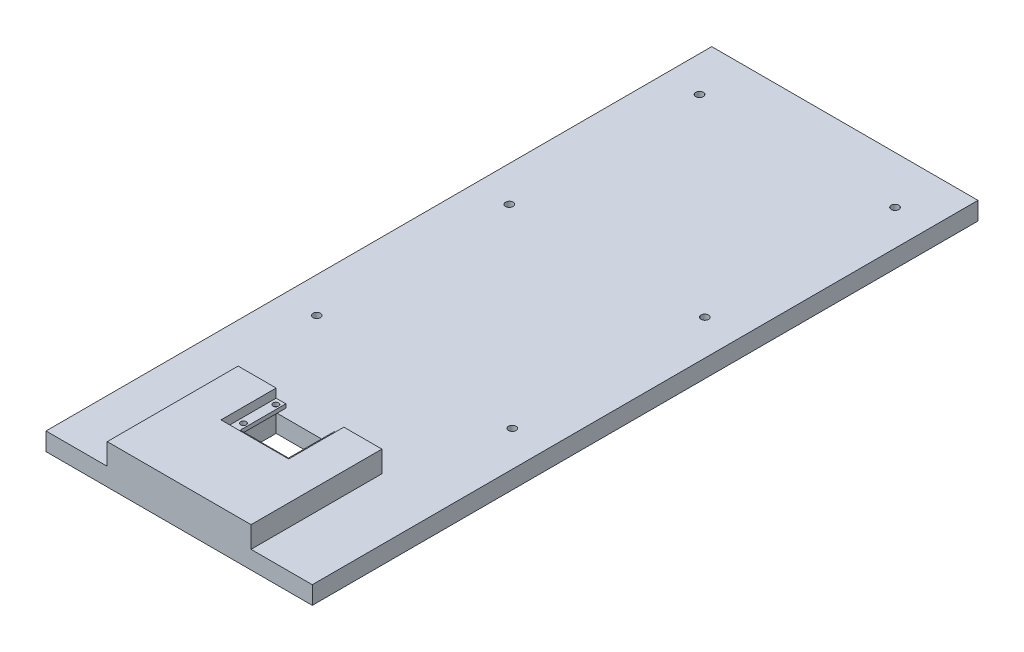
ISO-10303-21;
HEADER;
FILE_DESCRIPTION(('STEP AP214'),'2;1');
FILE_NAME('part.step','',(''),(''),'','','');
FILE_SCHEMA(('AUTOMOTIVE_DESIGN { 1 0 10303 214 1 1 1 1 }'));
ENDSEC;
DATA;
#1=APPLICATION_CONTEXT('core data for automotive mechanical design processes');
#2=APPLICATION_PROTOCOL_DEFINITION('international standard','automotive_design',2000,#1);
#3=PRODUCT_CONTEXT('',#1,'mechanical');
#4=PRODUCT('Part','Part','',(#3));
#5=PRODUCT_RELATED_PRODUCT_CATEGORY('part','',(#4));
#6=PRODUCT_DEFINITION_FORMATION('','',#4);
#7=PRODUCT_DEFINITION_CONTEXT('part definition',#1,'design');
#8=PRODUCT_DEFINITION('design','',#6,#7);
#9=PRODUCT_DEFINITION_SHAPE('','',#8);
#10=(LENGTH_UNIT() NAMED_UNIT(*) SI_UNIT(.MILLI.,.METRE.));
#11=(NAMED_UNIT(*) PLANE_ANGLE_UNIT() SI_UNIT($,.RADIAN.));
#12=(NAMED_UNIT(*) SI_UNIT($,.STERADIAN.) SOLID_ANGLE_UNIT());
#13=UNCERTAINTY_MEASURE_WITH_UNIT(LENGTH_MEASURE(1.E-05),#10,'distance_accuracy_value','');
#14=(GEOMETRIC_REPRESENTATION_CONTEXT(3) GLOBAL_UNCERTAINTY_ASSIGNED_CONTEXT((#13)) GLOBAL_UNIT_ASSIGNED_CONTEXT((#10,
#11,#12)) REPRESENTATION_CONTEXT('',''));
#15=CARTESIAN_POINT('',(0.,0.,0.));
#16=DIRECTION('',(0.,0.,1.));
#17=DIRECTION('',(1.,0.,0.));
#18=AXIS2_PLACEMENT_3D('',#15,#16,#17);
#19=CARTESIAN_POINT('',(0.,-4.62,0.));
#20=DIRECTION('',(0.,-1.,0.));
#21=DIRECTION('',(0.,0.,-1.));
#22=AXIS2_PLACEMENT_3D('',#19,#20,#21);
#23=PLANE('',#22);
#24=CARTESIAN_POINT('',(51.4,-4.62,-159.2));
#25=DIRECTION('',(0.,1.,0.));
#26=DIRECTION('',(0.,0.,1.));
#27=AXIS2_PLACEMENT_3D('',#24,#25,#26);
#28=CIRCLE('',#27,2.);
#29=CARTESIAN_POINT('',(51.4,-4.62,-157.2));
#30=VERTEX_POINT('',#29);
#31=EDGE_CURVE('E782',#30,#30,#28,.T.);
#32=ORIENTED_EDGE('',*,*,#31,.F.);
#33=EDGE_LOOP('',(#32));
#34=FACE_BOUND('',#33,.T.);
#35=CARTESIAN_POINT('',(51.4,-4.62,-57.95));
#36=DIRECTION('',(0.,1.,0.));
#37=DIRECTION('',(0.,0.,1.));
#38=AXIS2_PLACEMENT_3D('',#35,#36,#37);
#39=CIRCLE('',#38,2.);
#40=CARTESIAN_POINT('',(51.4,-4.62,-55.95));
#41=VERTEX_POINT('',#40);
#42=EDGE_CURVE('E791',#41,#41,#39,.T.);
#43=ORIENTED_EDGE('',*,*,#42,.F.);
#44=EDGE_LOOP('',(#43));
#45=FACE_BOUND('',#44,.T.);
#46=CARTESIAN_POINT('',(51.4,-4.62,-259.2));
#47=DIRECTION('',(0.,1.,0.));
#48=DIRECTION('',(0.,0.,1.));
#49=AXIS2_PLACEMENT_3D('',#46,#47,#48);
#50=CIRCLE('',#49,2.);
#51=CARTESIAN_POINT('',(51.4,-4.62,-257.2));
#52=VERTEX_POINT('',#51);
#53=EDGE_CURVE('E799',#52,#52,#50,.T.);
#54=ORIENTED_EDGE('',*,*,#53,.F.);
#55=EDGE_LOOP('',(#54));
#56=FACE_BOUND('',#55,.T.);
#57=DIRECTION('',(1.,0.,0.));
#58=VECTOR('',#57,1.);
#59=CARTESIAN_POINT('',(0.,-4.62,-3.));
#60=LINE('',#59,#58);
#61=CARTESIAN_POINT('',(-17.8,-4.62,-3.));
#62=VERTEX_POINT('',#61);
#63=CARTESIAN_POINT('',(17.8,-4.62,-3.));
#64=VERTEX_POINT('',#63);
#65=EDGE_CURVE('E282',#62,#64,#60,.T.);
#66=ORIENTED_EDGE('',*,*,#65,.T.);
#67=DIRECTION('',(1.,0.,0.));
#68=VECTOR('',#67,1.);
#69=CARTESIAN_POINT('',(0.,-4.62,-3.));
#70=LINE('',#69,#68);
#71=CARTESIAN_POINT('',(37.8,-4.62,-3.));
#72=VERTEX_POINT('',#71);
#73=EDGE_CURVE('E475',#64,#72,#70,.T.);
#74=ORIENTED_EDGE('',*,*,#73,.T.);
#75=DIRECTION('',(0.,0.,1.));
#76=VECTOR('',#75,1.);
#77=CARTESIAN_POINT('',(37.8,-4.62,0.));
#78=LINE('',#77,#76);
#79=CARTESIAN_POINT('',(37.8,-4.62,65.8));
#80=VERTEX_POINT('',#79);
#81=EDGE_CURVE('E495',#72,#80,#78,.T.);
#82=ORIENTED_EDGE('',*,*,#81,.T.);
#83=DIRECTION('',(-1.,0.,0.));
#84=VECTOR('',#83,1.);
#85=CARTESIAN_POINT('',(0.,-4.62,65.8));
#86=LINE('',#85,#84);
#87=CARTESIAN_POINT('',(70.,-4.62,65.8));
#88=VERTEX_POINT('',#87);
#89=EDGE_CURVE('E290',#88,#80,#86,.T.);
#90=ORIENTED_EDGE('',*,*,#89,.F.);
#91=DIRECTION('',(0.,0.,-1.));
#92=VECTOR('',#91,1.);
#93=CARTESIAN_POINT('',(70.,-4.62,0.));
#94=LINE('',#93,#92);
#95=CARTESIAN_POINT('',(70.,-4.62,-284.2));
#96=VERTEX_POINT('',#95);
#97=EDGE_CURVE('E285',#88,#96,#94,.T.);
#98=ORIENTED_EDGE('',*,*,#97,.T.);
#99=DIRECTION('',(1.,0.,0.));
#100=VECTOR('',#99,1.);
#101=CARTESIAN_POINT('',(0.,-4.62,-284.2));
#102=LINE('',#101,#100);
#103=CARTESIAN_POINT('',(-70.,-4.62,-284.2));
#104=VERTEX_POINT('',#103);
#105=EDGE_CURVE('E241',#104,#96,#102,.T.);
#106=ORIENTED_EDGE('',*,*,#105,.F.);
#107=DIRECTION('',(0.,0.,-1.));
#108=VECTOR('',#107,1.);
#109=CARTESIAN_POINT('',(-70.,-4.62,0.));
#110=LINE('',#109,#108);
#111=CARTESIAN_POINT('',(-70.,-4.62,65.8));
#112=VERTEX_POINT('',#111);
#113=EDGE_CURVE('E294',#112,#104,#110,.T.);
#114=ORIENTED_EDGE('',*,*,#113,.F.);
#115=CARTESIAN_POINT('',(-37.8,-4.62,65.8));
#116=VERTEX_POINT('',#115);
#117=EDGE_CURVE('E289',#116,#112,#86,.T.);
#118=ORIENTED_EDGE('',*,*,#117,.F.);
#119=DIRECTION('',(0.,0.,-1.));
#120=VECTOR('',#119,1.);
#121=CARTESIAN_POINT('',(-37.8,-4.62,0.));
#122=LINE('',#121,#120);
#123=CARTESIAN_POINT('',(-37.8,-4.62,-3.));
#124=VERTEX_POINT('',#123);
#125=EDGE_CURVE('E492',#116,#124,#122,.T.);
#126=ORIENTED_EDGE('',*,*,#125,.T.);
#127=DIRECTION('',(-1.,0.,0.));
#128=VECTOR('',#127,1.);
#129=CARTESIAN_POINT('',(0.,-4.62,-3.));
#130=LINE('',#129,#128);
#131=EDGE_CURVE('E468',#62,#124,#130,.T.);
#132=ORIENTED_EDGE('',*,*,#131,.F.);
#133=EDGE_LOOP('',(#66,#74,#82,#90,#98,#106,#114,#118,#126,#132));
#134=FACE_BOUND('',#133,.T.);
#135=CARTESIAN_POINT('',(-51.4,-4.62,-259.2));
#136=DIRECTION('',(0.,1.,0.));
#137=DIRECTION('',(0.,0.,1.));
#138=AXIS2_PLACEMENT_3D('',#135,#136,#137);
#139=CIRCLE('',#138,2.);
#140=CARTESIAN_POINT('',(-51.4,-4.62,-257.2));
#141=VERTEX_POINT('',#140);
#142=EDGE_CURVE('E795',#141,#141,#139,.F.);
#143=ORIENTED_EDGE('',*,*,#142,.T.);
#144=EDGE_LOOP('',(#143));
#145=FACE_BOUND('',#144,.T.);
#146=CARTESIAN_POINT('',(-51.4,-4.62,-159.2));
#147=DIRECTION('',(0.,1.,0.));
#148=DIRECTION('',(0.,0.,1.));
#149=AXIS2_PLACEMENT_3D('',#146,#147,#148);
#150=CIRCLE('',#149,2.);
#151=CARTESIAN_POINT('',(-51.4,-4.62,-157.2));
#152=VERTEX_POINT('',#151);
#153=EDGE_CURVE('E804',#152,#152,#150,.F.);
#154=ORIENTED_EDGE('',*,*,#153,.T.);
#155=EDGE_LOOP('',(#154));
#156=FACE_BOUND('',#155,.T.);
#157=CARTESIAN_POINT('',(-51.4,-4.62,-57.95));
#158=DIRECTION('',(0.,1.,0.));
#159=DIRECTION('',(0.,0.,1.));
#160=AXIS2_PLACEMENT_3D('',#157,#158,#159);
#161=CIRCLE('',#160,2.);
#162=CARTESIAN_POINT('',(-51.4,-4.62,-55.95));
#163=VERTEX_POINT('',#162);
#164=EDGE_CURVE('E789',#163,#163,#161,.F.);
#165=ORIENTED_EDGE('',*,*,#164,.T.);
#166=EDGE_LOOP('',(#165));
#167=FACE_BOUND('',#166,.T.);
#168=ADVANCED_FACE('F81',(#34,#45,#56,#134,#145,#156,#167),#23,.F.);
#169=CARTESIAN_POINT('',(0.,-14.05,0.));
#170=DIRECTION('',(0.,-1.,0.));
#171=DIRECTION('',(0.,0.,-1.));
#172=AXIS2_PLACEMENT_3D('',#169,#170,#171);
#173=PLANE('',#172);
#174=CARTESIAN_POINT('',(51.4,-14.05,-159.2));
#175=DIRECTION('',(0.,1.,0.));
#176=DIRECTION('',(0.,0.,1.));
#177=AXIS2_PLACEMENT_3D('',#174,#175,#176);
#178=CIRCLE('',#177,2.);
#179=CARTESIAN_POINT('',(51.4,-14.05,-157.2));
#180=VERTEX_POINT('',#179);
#181=EDGE_CURVE('E780',#180,#180,#178,.T.);
#182=ORIENTED_EDGE('',*,*,#181,.T.);
#183=EDGE_LOOP('',(#182));
#184=FACE_BOUND('',#183,.T.);
#185=CARTESIAN_POINT('',(-51.4,-14.05,-159.2));
#186=DIRECTION('',(0.,1.,0.));
#187=DIRECTION('',(0.,0.,1.));
#188=AXIS2_PLACEMENT_3D('',#185,#186,#187);
#189=CIRCLE('',#188,2.);
#190=CARTESIAN_POINT('',(-51.4,-14.05,-157.2));
#191=VERTEX_POINT('',#190);
#192=EDGE_CURVE('E808',#191,#191,#189,.F.);
#193=ORIENTED_EDGE('',*,*,#192,.F.);
#194=EDGE_LOOP('',(#193));
#195=FACE_BOUND('',#194,.T.);
#196=DIRECTION('',(0.,0.,1.));
#197=VECTOR('',#196,1.);
#198=CARTESIAN_POINT('',(17.8,-14.05,27.));
#199=LINE('',#198,#197);
#200=CARTESIAN_POINT('',(17.8,-14.05,-3.));
#201=VERTEX_POINT('',#200);
#202=CARTESIAN_POINT('',(17.8,-14.05,27.));
#203=VERTEX_POINT('',#202);
#204=EDGE_CURVE('E231',#201,#203,#199,.T.);
#205=ORIENTED_EDGE('',*,*,#204,.F.);
#206=DIRECTION('',(1.,0.,0.));
#207=VECTOR('',#206,1.);
#208=CARTESIAN_POINT('',(-17.8,-14.05,-3.));
#209=LINE('',#208,#207);
#210=CARTESIAN_POINT('',(-17.8,-14.05,-3.));
#211=VERTEX_POINT('',#210);
#212=EDGE_CURVE('E244',#211,#201,#209,.T.);
#213=ORIENTED_EDGE('',*,*,#212,.F.);
#214=DIRECTION('',(0.,0.,-1.));
#215=VECTOR('',#214,1.);
#216=CARTESIAN_POINT('',(-17.8,-14.05,-3.));
#217=LINE('',#216,#215);
#218=CARTESIAN_POINT('',(-17.8,-14.05,27.));
#219=VERTEX_POINT('',#218);
#220=EDGE_CURVE('E260',#219,#211,#217,.T.);
#221=ORIENTED_EDGE('',*,*,#220,.F.);
#222=DIRECTION('',(-1.,0.,0.));
#223=VECTOR('',#222,1.);
#224=CARTESIAN_POINT('',(-17.8,-14.05,27.));
#225=LINE('',#224,#223);
#226=EDGE_CURVE('E256',#203,#219,#225,.T.);
#227=ORIENTED_EDGE('',*,*,#226,.F.);
#228=EDGE_LOOP('',(#205,#213,#221,#227));
#229=FACE_BOUND('',#228,.T.);
#230=DIRECTION('',(1.,0.,0.));
#231=VECTOR('',#230,1.);
#232=CARTESIAN_POINT('',(-70.,-14.05,-284.2));
#233=LINE('',#232,#231);
#234=CARTESIAN_POINT('',(-70.,-14.05,-284.2));
#235=VERTEX_POINT('',#234);
#236=CARTESIAN_POINT('',(70.,-14.05,-284.2));
#237=VERTEX_POINT('',#236);
#238=EDGE_CURVE('E266',#235,#237,#233,.T.);
#239=ORIENTED_EDGE('',*,*,#238,.T.);
#240=DIRECTION('',(0.,0.,1.));
#241=VECTOR('',#240,1.);
#242=CARTESIAN_POINT('',(70.,-14.05,-284.2));
#243=LINE('',#242,#241);
#244=CARTESIAN_POINT('',(70.,-14.05,65.8));
#245=VERTEX_POINT('',#244);
#246=EDGE_CURVE('E270',#237,#245,#243,.T.);
#247=ORIENTED_EDGE('',*,*,#246,.T.);
#248=DIRECTION('',(-1.,0.,0.));
#249=VECTOR('',#248,1.);
#250=CARTESIAN_POINT('',(70.,-14.05,65.8));
#251=LINE('',#250,#249);
#252=CARTESIAN_POINT('',(-70.,-14.05,65.8));
#253=VERTEX_POINT('',#252);
#254=EDGE_CURVE('E274',#245,#253,#251,.T.);
#255=ORIENTED_EDGE('',*,*,#254,.T.);
#256=DIRECTION('',(0.,0.,-1.));
#257=VECTOR('',#256,1.);
#258=CARTESIAN_POINT('',(-70.,-14.05,65.8));
#259=LINE('',#258,#257);
#260=EDGE_CURVE('E278',#253,#235,#259,.T.);
#261=ORIENTED_EDGE('',*,*,#260,.T.);
#262=EDGE_LOOP('',(#239,#247,#255,#261));
#263=FACE_BOUND('',#262,.T.);
#264=CARTESIAN_POINT('',(51.4,-14.05,-259.2));
#265=DIRECTION('',(0.,1.,0.));
#266=DIRECTION('',(0.,0.,1.));
#267=AXIS2_PLACEMENT_3D('',#264,#265,#266);
#268=CIRCLE('',#267,2.);
#269=CARTESIAN_POINT('',(51.4,-14.05,-257.2));
#270=VERTEX_POINT('',#269);
#271=EDGE_CURVE('E251',#270,#270,#268,.T.);
#272=ORIENTED_EDGE('',*,*,#271,.T.);
#273=EDGE_LOOP('',(#272));
#274=FACE_BOUND('',#273,.T.);
#275=CARTESIAN_POINT('',(51.4,-14.05,-57.95));
#276=DIRECTION('',(0.,1.,0.));
#277=DIRECTION('',(0.,0.,1.));
#278=AXIS2_PLACEMENT_3D('',#275,#276,#277);
#279=CIRCLE('',#278,2.);
#280=CARTESIAN_POINT('',(51.4,-14.05,-55.95));
#281=VERTEX_POINT('',#280);
#282=EDGE_CURVE('E824',#281,#281,#279,.T.);
#283=ORIENTED_EDGE('',*,*,#282,.T.);
#284=EDGE_LOOP('',(#283));
#285=FACE_BOUND('',#284,.T.);
#286=CARTESIAN_POINT('',(-51.4,-14.05,-259.2));
#287=DIRECTION('',(0.,1.,0.));
#288=DIRECTION('',(0.,0.,1.));
#289=AXIS2_PLACEMENT_3D('',#286,#287,#288);
#290=CIRCLE('',#289,2.);
#291=CARTESIAN_POINT('',(-51.4,-14.05,-257.2));
#292=VERTEX_POINT('',#291);
#293=EDGE_CURVE('E800',#292,#292,#290,.F.);
#294=ORIENTED_EDGE('',*,*,#293,.F.);
#295=EDGE_LOOP('',(#294));
#296=FACE_BOUND('',#295,.T.);
#297=CARTESIAN_POINT('',(-51.4,-14.05,-57.95));
#298=DIRECTION('',(0.,1.,0.));
#299=DIRECTION('',(0.,0.,1.));
#300=AXIS2_PLACEMENT_3D('',#297,#298,#299);
#301=CIRCLE('',#300,2.);
#302=CARTESIAN_POINT('',(-51.4,-14.05,-55.95));
#303=VERTEX_POINT('',#302);
#304=EDGE_CURVE('E784',#303,#303,#301,.F.);
#305=ORIENTED_EDGE('',*,*,#304,.F.);
#306=EDGE_LOOP('',(#305));
#307=FACE_BOUND('',#306,.T.);
#308=ADVANCED_FACE('F253',(#184,#195,#229,#263,#274,#285,#296,#307),#173,.T.);
#309=CARTESIAN_POINT('',(37.8,2.,0.));
#310=DIRECTION('',(-1.,0.,0.));
#311=DIRECTION('',(0.,0.,1.));
#312=AXIS2_PLACEMENT_3D('',#309,#310,#311);
#313=PLANE('',#312);
#314=DIRECTION('',(0.,1.,0.));
#315=VECTOR('',#314,1.);
#316=CARTESIAN_POINT('',(37.8,-4.62,-3.));
#317=LINE('',#316,#315);
#318=CARTESIAN_POINT('',(37.8,6.62,-3.));
#319=VERTEX_POINT('',#318);
#320=EDGE_CURVE('E383',#72,#319,#317,.T.);
#321=ORIENTED_EDGE('',*,*,#320,.T.);
#322=DIRECTION('',(0.,0.,-1.));
#323=VECTOR('',#322,1.);
#324=CARTESIAN_POINT('',(37.8,6.62,0.));
#325=LINE('',#324,#323);
#326=CARTESIAN_POINT('',(37.8,6.62,65.8));
#327=VERTEX_POINT('',#326);
#328=EDGE_CURVE('E342',#327,#319,#325,.T.);
#329=ORIENTED_EDGE('',*,*,#328,.F.);
#330=DIRECTION('',(0.,-1.,0.));
#331=VECTOR('',#330,1.);
#332=CARTESIAN_POINT('',(37.8,2.,65.8));
#333=LINE('',#332,#331);
#334=EDGE_CURVE('E370',#327,#80,#333,.T.);
#335=ORIENTED_EDGE('',*,*,#334,.T.);
#336=ORIENTED_EDGE('',*,*,#81,.F.);
#337=EDGE_LOOP('',(#321,#329,#335,#336));
#338=FACE_BOUND('',#337,.T.);
#339=ADVANCED_FACE('F552',(#338),#313,.F.);
#340=CARTESIAN_POINT('',(0.,2.,0.));
#341=DIRECTION('',(0.,1.,0.));
#342=DIRECTION('',(0.,0.,1.));
#343=AXIS2_PLACEMENT_3D('',#340,#341,#342);
#344=PLANE('',#343);
#345=DIRECTION('',(0.,0.,1.));
#346=VECTOR('',#345,1.);
#347=CARTESIAN_POINT('',(17.8,2.,0.));
#348=LINE('',#347,#346);
#349=CARTESIAN_POINT('',(17.8,2.,-3.));
#350=VERTEX_POINT('',#349);
#351=CARTESIAN_POINT('',(17.8,2.,25.9964104934695));
#352=VERTEX_POINT('',#351);
#353=EDGE_CURVE('E314',#350,#352,#348,.T.);
#354=ORIENTED_EDGE('',*,*,#353,.F.);
#355=DIRECTION('',(-1.,0.,0.));
#356=VECTOR('',#355,1.);
#357=CARTESIAN_POINT('',(0.,2.,-3.));
#358=LINE('',#357,#356);
#359=CARTESIAN_POINT('',(12.7,2.,-3.));
#360=VERTEX_POINT('',#359);
#361=EDGE_CURVE('E462',#350,#360,#358,.T.);
#362=ORIENTED_EDGE('',*,*,#361,.T.);
#363=DIRECTION('',(0.,0.,1.));
#364=VECTOR('',#363,1.);
#365=CARTESIAN_POINT('',(12.7,2.,-25.));
#366=LINE('',#365,#364);
#367=CARTESIAN_POINT('',(12.7,2.,21.));
#368=VERTEX_POINT('',#367);
#369=EDGE_CURVE('E389',#360,#368,#366,.T.);
#370=ORIENTED_EDGE('',*,*,#369,.T.);
#371=DIRECTION('',(1.,0.,0.));
#372=VECTOR('',#371,1.);
#373=CARTESIAN_POINT('',(-12.7,2.,21.));
#374=LINE('',#373,#372);
#375=CARTESIAN_POINT('',(-12.7,2.,21.));
#376=VERTEX_POINT('',#375);
#377=EDGE_CURVE('E439',#376,#368,#374,.T.);
#378=ORIENTED_EDGE('',*,*,#377,.F.);
#379=DIRECTION('',(0.,0.,1.));
#380=VECTOR('',#379,1.);
#381=CARTESIAN_POINT('',(-12.7,2.,-25.));
#382=LINE('',#381,#380);
#383=CARTESIAN_POINT('',(-12.7,2.,-3.));
#384=VERTEX_POINT('',#383);
#385=EDGE_CURVE('E433',#384,#376,#382,.T.);
#386=ORIENTED_EDGE('',*,*,#385,.F.);
#387=DIRECTION('',(1.,0.,0.));
#388=VECTOR('',#387,1.);
#389=CARTESIAN_POINT('',(0.,2.,-3.));
#390=LINE('',#389,#388);
#391=CARTESIAN_POINT('',(-17.8,2.,-3.));
#392=VERTEX_POINT('',#391);
#393=EDGE_CURVE('E104',#392,#384,#390,.T.);
#394=ORIENTED_EDGE('',*,*,#393,.F.);
#395=DIRECTION('',(0.,0.,1.));
#396=VECTOR('',#395,1.);
#397=CARTESIAN_POINT('',(-17.8,2.,0.));
#398=LINE('',#397,#396);
#399=CARTESIAN_POINT('',(-17.8,2.,25.9964104934695));
#400=VERTEX_POINT('',#399);
#401=EDGE_CURVE('E323',#392,#400,#398,.T.);
#402=ORIENTED_EDGE('',*,*,#401,.T.);
#403=DIRECTION('',(-1.,0.,0.));
#404=VECTOR('',#403,1.);
#405=CARTESIAN_POINT('',(0.,2.,25.9964104934695));
#406=LINE('',#405,#404);
#407=EDGE_CURVE('E98',#352,#400,#406,.T.);
#408=ORIENTED_EDGE('',*,*,#407,.F.);
#409=EDGE_LOOP('',(#354,#362,#370,#378,#386,#394,#402,#408));
#410=FACE_BOUND('',#409,.T.);
#411=CARTESIAN_POINT('',(-15.,2.,0.));
#412=DIRECTION('',(0.,1.,0.));
#413=DIRECTION('',(0.,0.,1.));
#414=AXIS2_PLACEMENT_3D('',#411,#412,#413);
#415=CIRCLE('',#414,1.5);
#416=CARTESIAN_POINT('',(-15.,2.,1.5));
#417=VERTEX_POINT('',#416);
#418=EDGE_CURVE('E378',#417,#417,#415,.T.);
#419=ORIENTED_EDGE('',*,*,#418,.F.);
#420=EDGE_LOOP('',(#419));
#421=FACE_BOUND('',#420,.T.);
#422=CARTESIAN_POINT('',(-15.,2.,17.));
#423=DIRECTION('',(0.,1.,0.));
#424=DIRECTION('',(0.,0.,1.));
#425=AXIS2_PLACEMENT_3D('',#422,#423,#424);
#426=CIRCLE('',#425,1.5);
#427=CARTESIAN_POINT('',(-15.,2.,18.5));
#428=VERTEX_POINT('',#427);
#429=EDGE_CURVE('E413',#428,#428,#426,.T.);
#430=ORIENTED_EDGE('',*,*,#429,.F.);
#431=EDGE_LOOP('',(#430));
#432=FACE_BOUND('',#431,.T.);
#433=CARTESIAN_POINT('',(15.,2.,0.));
#434=DIRECTION('',(0.,1.,0.));
#435=DIRECTION('',(0.,0.,1.));
#436=AXIS2_PLACEMENT_3D('',#433,#434,#435);
#437=CIRCLE('',#436,1.5);
#438=CARTESIAN_POINT('',(15.,2.,1.5));
#439=VERTEX_POINT('',#438);
#440=EDGE_CURVE('E417',#439,#439,#437,.T.);
#441=ORIENTED_EDGE('',*,*,#440,.F.);
#442=EDGE_LOOP('',(#441));
#443=FACE_BOUND('',#442,.T.);
#444=CARTESIAN_POINT('',(15.,2.,17.));
#445=DIRECTION('',(0.,1.,0.));
#446=DIRECTION('',(0.,0.,1.));
#447=AXIS2_PLACEMENT_3D('',#444,#445,#446);
#448=CIRCLE('',#447,1.5);
#449=CARTESIAN_POINT('',(15.,2.,18.5));
#450=VERTEX_POINT('',#449);
#451=EDGE_CURVE('E421',#450,#450,#448,.T.);
#452=ORIENTED_EDGE('',*,*,#451,.F.);
#453=EDGE_LOOP('',(#452));
#454=FACE_BOUND('',#453,.T.);
#455=CARTESIAN_POINT('',(-8.49999999999999,2.,23.3));
#456=DIRECTION('',(0.,1.,0.));
#457=DIRECTION('',(0.,0.,1.));
#458=AXIS2_PLACEMENT_3D('',#455,#456,#457);
#459=CIRCLE('',#458,1.5);
#460=CARTESIAN_POINT('',(-8.49999999999999,2.,24.8));
#461=VERTEX_POINT('',#460);
#462=EDGE_CURVE('E425',#461,#461,#459,.T.);
#463=ORIENTED_EDGE('',*,*,#462,.F.);
#464=EDGE_LOOP('',(#463));
#465=FACE_BOUND('',#464,.T.);
#466=CARTESIAN_POINT('',(8.50000000000001,2.,23.3));
#467=DIRECTION('',(0.,1.,0.));
#468=DIRECTION('',(0.,0.,1.));
#469=AXIS2_PLACEMENT_3D('',#466,#467,#468);
#470=CIRCLE('',#469,1.5);
#471=CARTESIAN_POINT('',(8.50000000000001,2.,24.8));
#472=VERTEX_POINT('',#471);
#473=EDGE_CURVE('E429',#472,#472,#470,.T.);
#474=ORIENTED_EDGE('',*,*,#473,.F.);
#475=EDGE_LOOP('',(#474));
#476=FACE_BOUND('',#475,.T.);
#477=ADVANCED_FACE('F529',(#410,#421,#432,#443,#454,#465,#476),#344,.T.);
#478=CARTESIAN_POINT('',(0.,0.,0.));
#479=DIRECTION('',(0.,1.,0.));
#480=DIRECTION('',(0.,0.,1.));
#481=AXIS2_PLACEMENT_3D('',#478,#479,#480);
#482=PLANE('',#481);
#483=CARTESIAN_POINT('',(-15.,0.,0.));
#484=DIRECTION('',(0.,1.,0.));
#485=DIRECTION('',(0.,0.,1.));
#486=AXIS2_PLACEMENT_3D('',#483,#484,#485);
#487=CIRCLE('',#486,1.5);
#488=CARTESIAN_POINT('',(-15.,0.,1.5));
#489=VERTEX_POINT('',#488);
#490=EDGE_CURVE('E384',#489,#489,#487,.T.);
#491=ORIENTED_EDGE('',*,*,#490,.T.);
#492=EDGE_LOOP('',(#491));
#493=FACE_BOUND('',#492,.T.);
#494=CARTESIAN_POINT('',(-15.,0.,17.));
#495=DIRECTION('',(0.,1.,0.));
#496=DIRECTION('',(0.,0.,1.));
#497=AXIS2_PLACEMENT_3D('',#494,#495,#496);
#498=CIRCLE('',#497,1.5);
#499=CARTESIAN_POINT('',(-15.,0.,18.5));
#500=VERTEX_POINT('',#499);
#501=EDGE_CURVE('E388',#500,#500,#498,.T.);
#502=ORIENTED_EDGE('',*,*,#501,.T.);
#503=EDGE_LOOP('',(#502));
#504=FACE_BOUND('',#503,.T.);
#505=CARTESIAN_POINT('',(15.,0.,0.));
#506=DIRECTION('',(0.,1.,0.));
#507=DIRECTION('',(0.,0.,1.));
#508=AXIS2_PLACEMENT_3D('',#505,#506,#507);
#509=CIRCLE('',#508,1.5);
#510=CARTESIAN_POINT('',(15.,0.,1.5));
#511=VERTEX_POINT('',#510);
#512=EDGE_CURVE('E393',#511,#511,#509,.T.);
#513=ORIENTED_EDGE('',*,*,#512,.T.);
#514=EDGE_LOOP('',(#513));
#515=FACE_BOUND('',#514,.T.);
#516=CARTESIAN_POINT('',(15.,0.,17.));
#517=DIRECTION('',(0.,1.,0.));
#518=DIRECTION('',(0.,0.,1.));
#519=AXIS2_PLACEMENT_3D('',#516,#517,#518);
#520=CIRCLE('',#519,1.5);
#521=CARTESIAN_POINT('',(15.,0.,18.5));
#522=VERTEX_POINT('',#521);
#523=EDGE_CURVE('E397',#522,#522,#520,.T.);
#524=ORIENTED_EDGE('',*,*,#523,.T.);
#525=EDGE_LOOP('',(#524));
#526=FACE_BOUND('',#525,.T.);
#527=CARTESIAN_POINT('',(-8.49999999999999,0.,23.3));
#528=DIRECTION('',(0.,1.,0.));
#529=DIRECTION('',(0.,0.,1.));
#530=AXIS2_PLACEMENT_3D('',#527,#528,#529);
#531=CIRCLE('',#530,1.5);
#532=CARTESIAN_POINT('',(-8.49999999999999,0.,24.8));
#533=VERTEX_POINT('',#532);
#534=EDGE_CURVE('E401',#533,#533,#531,.T.);
#535=ORIENTED_EDGE('',*,*,#534,.T.);
#536=EDGE_LOOP('',(#535));
#537=FACE_BOUND('',#536,.T.);
#538=CARTESIAN_POINT('',(8.50000000000001,0.,23.3));
#539=DIRECTION('',(0.,1.,0.));
#540=DIRECTION('',(0.,0.,1.));
#541=AXIS2_PLACEMENT_3D('',#538,#539,#540);
#542=CIRCLE('',#541,1.5);
#543=CARTESIAN_POINT('',(8.50000000000001,0.,24.8));
#544=VERTEX_POINT('',#543);
#545=EDGE_CURVE('E405',#544,#544,#542,.T.);
#546=ORIENTED_EDGE('',*,*,#545,.T.);
#547=EDGE_LOOP('',(#546));
#548=FACE_BOUND('',#547,.T.);
#549=DIRECTION('',(1.,0.,0.));
#550=VECTOR('',#549,1.);
#551=CARTESIAN_POINT('',(0.,0.,-3.));
#552=LINE('',#551,#550);
#553=CARTESIAN_POINT('',(12.7,0.,-3.));
#554=VERTEX_POINT('',#553);
#555=CARTESIAN_POINT('',(17.8,0.,-3.));
#556=VERTEX_POINT('',#555);
#557=EDGE_CURVE('E409',#554,#556,#552,.T.);
#558=ORIENTED_EDGE('',*,*,#557,.T.);
#559=DIRECTION('',(0.,0.,1.));
#560=VECTOR('',#559,1.);
#561=CARTESIAN_POINT('',(17.8,0.,0.));
#562=LINE('',#561,#560);
#563=CARTESIAN_POINT('',(17.8,0.,27.));
#564=VERTEX_POINT('',#563);
#565=EDGE_CURVE('E482',#556,#564,#562,.T.);
#566=ORIENTED_EDGE('',*,*,#565,.T.);
#567=DIRECTION('',(-1.,0.,0.));
#568=VECTOR('',#567,1.);
#569=CARTESIAN_POINT('',(0.,0.,27.));
#570=LINE('',#569,#568);
#571=CARTESIAN_POINT('',(-17.8,0.,27.));
#572=VERTEX_POINT('',#571);
#573=EDGE_CURVE('E448',#564,#572,#570,.T.);
#574=ORIENTED_EDGE('',*,*,#573,.T.);
#575=DIRECTION('',(0.,0.,1.));
#576=VECTOR('',#575,1.);
#577=CARTESIAN_POINT('',(-17.8,0.,0.));
#578=LINE('',#577,#576);
#579=CARTESIAN_POINT('',(-17.8,0.,-3.));
#580=VERTEX_POINT('',#579);
#581=EDGE_CURVE('E476',#580,#572,#578,.T.);
#582=ORIENTED_EDGE('',*,*,#581,.F.);
#583=DIRECTION('',(-1.,0.,0.));
#584=VECTOR('',#583,1.);
#585=CARTESIAN_POINT('',(0.,0.,-3.));
#586=LINE('',#585,#584);
#587=CARTESIAN_POINT('',(-12.7,0.,-3.));
#588=VERTEX_POINT('',#587);
#589=EDGE_CURVE('E85',#588,#580,#586,.T.);
#590=ORIENTED_EDGE('',*,*,#589,.F.);
#591=DIRECTION('',(0.,0.,1.));
#592=VECTOR('',#591,1.);
#593=CARTESIAN_POINT('',(-12.7,0.,-25.));
#594=LINE('',#593,#592);
#595=CARTESIAN_POINT('',(-12.7,0.,21.));
#596=VERTEX_POINT('',#595);
#597=EDGE_CURVE('E444',#588,#596,#594,.T.);
#598=ORIENTED_EDGE('',*,*,#597,.T.);
#599=DIRECTION('',(1.,0.,0.));
#600=VECTOR('',#599,1.);
#601=CARTESIAN_POINT('',(-12.7,0.,21.));
#602=LINE('',#601,#600);
#603=CARTESIAN_POINT('',(12.7,0.,21.));
#604=VERTEX_POINT('',#603);
#605=EDGE_CURVE('E447',#596,#604,#602,.T.);
#606=ORIENTED_EDGE('',*,*,#605,.T.);
#607=DIRECTION('',(0.,0.,1.));
#608=VECTOR('',#607,1.);
#609=CARTESIAN_POINT('',(12.7,0.,-25.));
#610=LINE('',#609,#608);
#611=EDGE_CURVE('E452',#554,#604,#610,.T.);
#612=ORIENTED_EDGE('',*,*,#611,.F.);
#613=EDGE_LOOP('',(#558,#566,#574,#582,#590,#598,#606,#612));
#614=FACE_BOUND('',#613,.T.);
#615=ADVANCED_FACE('F83',(#493,#504,#515,#526,#537,#548,#614),#482,.F.);
#616=CARTESIAN_POINT('',(12.7,2.,-25.));
#617=DIRECTION('',(1.,0.,0.));
#618=DIRECTION('',(0.,0.,-1.));
#619=AXIS2_PLACEMENT_3D('',#616,#617,#618);
#620=PLANE('',#619);
#621=DIRECTION('',(0.,1.,0.));
#622=VECTOR('',#621,1.);
#623=CARTESIAN_POINT('',(12.7,2.,-3.));
#624=LINE('',#623,#622);
#625=EDGE_CURVE('E12',#554,#360,#624,.T.);
#626=ORIENTED_EDGE('',*,*,#625,.F.);
#627=ORIENTED_EDGE('',*,*,#611,.T.);
#628=DIRECTION('',(0.,-1.,0.));
#629=VECTOR('',#628,1.);
#630=CARTESIAN_POINT('',(12.7,2.,21.));
#631=LINE('',#630,#629);
#632=EDGE_CURVE('E434',#368,#604,#631,.T.);
#633=ORIENTED_EDGE('',*,*,#632,.F.);
#634=ORIENTED_EDGE('',*,*,#369,.F.);
#635=EDGE_LOOP('',(#626,#627,#633,#634));
#636=FACE_BOUND('',#635,.T.);
#637=ADVANCED_FACE('F537',(#636),#620,.F.);
#638=CARTESIAN_POINT('',(-37.8,2.,0.));
#639=DIRECTION('',(-1.,0.,0.));
#640=DIRECTION('',(0.,0.,1.));
#641=AXIS2_PLACEMENT_3D('',#638,#639,#640);
#642=PLANE('',#641);
#643=DIRECTION('',(0.,-1.,0.));
#644=VECTOR('',#643,1.);
#645=CARTESIAN_POINT('',(-37.8,10.,-3.));
#646=LINE('',#645,#644);
#647=CARTESIAN_POINT('',(-37.8,6.62,-3.));
#648=VERTEX_POINT('',#647);
#649=EDGE_CURVE('E379',#648,#124,#646,.T.);
#650=ORIENTED_EDGE('',*,*,#649,.T.);
#651=ORIENTED_EDGE('',*,*,#125,.F.);
#652=DIRECTION('',(0.,-1.,0.));
#653=VECTOR('',#652,1.);
#654=CARTESIAN_POINT('',(-37.8,2.,65.8));
#655=LINE('',#654,#653);
#656=CARTESIAN_POINT('',(-37.8,6.62,65.8));
#657=VERTEX_POINT('',#656);
#658=EDGE_CURVE('E374',#657,#116,#655,.T.);
#659=ORIENTED_EDGE('',*,*,#658,.F.);
#660=DIRECTION('',(0.,0.,1.));
#661=VECTOR('',#660,1.);
#662=CARTESIAN_POINT('',(-37.8,6.62,0.));
#663=LINE('',#662,#661);
#664=EDGE_CURVE('E334',#648,#657,#663,.T.);
#665=ORIENTED_EDGE('',*,*,#664,.F.);
#666=EDGE_LOOP('',(#650,#651,#659,#665));
#667=FACE_BOUND('',#666,.T.);
#668=ADVANCED_FACE('F576',(#667),#642,.T.);
#669=CARTESIAN_POINT('',(0.,2.,65.8));
#670=DIRECTION('',(0.,0.,-1.));
#671=DIRECTION('',(-1.,0.,0.));
#672=AXIS2_PLACEMENT_3D('',#669,#670,#671);
#673=PLANE('',#672);
#674=ORIENTED_EDGE('',*,*,#658,.T.);
#675=ORIENTED_EDGE('',*,*,#117,.T.);
#676=DIRECTION('',(0.,1.,0.));
#677=VECTOR('',#676,1.);
#678=CARTESIAN_POINT('',(-70.,-9.25,65.8));
#679=LINE('',#678,#677);
#680=EDGE_CURVE('E308',#253,#112,#679,.T.);
#681=ORIENTED_EDGE('',*,*,#680,.F.);
#682=ORIENTED_EDGE('',*,*,#254,.F.);
#683=DIRECTION('',(0.,1.,0.));
#684=VECTOR('',#683,1.);
#685=CARTESIAN_POINT('',(70.,-9.25,65.8));
#686=LINE('',#685,#684);
#687=EDGE_CURVE('E312',#245,#88,#686,.T.);
#688=ORIENTED_EDGE('',*,*,#687,.T.);
#689=ORIENTED_EDGE('',*,*,#89,.T.);
#690=ORIENTED_EDGE('',*,*,#334,.F.);
#691=DIRECTION('',(1.,0.,0.));
#692=VECTOR('',#691,1.);
#693=CARTESIAN_POINT('',(0.,6.62,65.8));
#694=LINE('',#693,#692);
#695=EDGE_CURVE('E338',#657,#327,#694,.T.);
#696=ORIENTED_EDGE('',*,*,#695,.F.);
#697=EDGE_LOOP('',(#674,#675,#681,#682,#688,#689,#690,#696));
#698=FACE_BOUND('',#697,.T.);
#699=ADVANCED_FACE('F558',(#698),#673,.F.);
#700=CARTESIAN_POINT('',(-15.,2.,0.));
#701=DIRECTION('',(0.,-1.,0.));
#702=DIRECTION('',(0.,0.,-1.));
#703=AXIS2_PLACEMENT_3D('',#700,#701,#702);
#704=CYLINDRICAL_SURFACE('',#703,1.5);
#705=ORIENTED_EDGE('',*,*,#418,.T.);
#706=EDGE_LOOP('',(#705));
#707=FACE_BOUND('',#706,.T.);
#708=ORIENTED_EDGE('',*,*,#490,.F.);
#709=EDGE_LOOP('',(#708));
#710=FACE_BOUND('',#709,.T.);
#711=ADVANCED_FACE('F656',(#707,#710),#704,.F.);
#712=CARTESIAN_POINT('',(-15.,2.,17.));
#713=DIRECTION('',(0.,-1.,0.));
#714=DIRECTION('',(0.,0.,-1.));
#715=AXIS2_PLACEMENT_3D('',#712,#713,#714);
#716=CYLINDRICAL_SURFACE('',#715,1.5);
#717=ORIENTED_EDGE('',*,*,#429,.T.);
#718=EDGE_LOOP('',(#717));
#719=FACE_BOUND('',#718,.T.);
#720=ORIENTED_EDGE('',*,*,#501,.F.);
#721=EDGE_LOOP('',(#720));
#722=FACE_BOUND('',#721,.T.);
#723=ADVANCED_FACE('F961',(#719,#722),#716,.F.);
#724=CARTESIAN_POINT('',(15.,2.,0.));
#725=DIRECTION('',(0.,-1.,0.));
#726=DIRECTION('',(0.,0.,-1.));
#727=AXIS2_PLACEMENT_3D('',#724,#725,#726);
#728=CYLINDRICAL_SURFACE('',#727,1.5);
#729=ORIENTED_EDGE('',*,*,#440,.T.);
#730=EDGE_LOOP('',(#729));
#731=FACE_BOUND('',#730,.T.);
#732=ORIENTED_EDGE('',*,*,#512,.F.);
#733=EDGE_LOOP('',(#732));
#734=FACE_BOUND('',#733,.T.);
#735=ADVANCED_FACE('F952',(#731,#734),#728,.F.);
#736=CARTESIAN_POINT('',(15.,2.,17.));
#737=DIRECTION('',(0.,-1.,0.));
#738=DIRECTION('',(0.,0.,-1.));
#739=AXIS2_PLACEMENT_3D('',#736,#737,#738);
#740=CYLINDRICAL_SURFACE('',#739,1.5);
#741=ORIENTED_EDGE('',*,*,#451,.T.);
#742=EDGE_LOOP('',(#741));
#743=FACE_BOUND('',#742,.T.);
#744=ORIENTED_EDGE('',*,*,#523,.F.);
#745=EDGE_LOOP('',(#744));
#746=FACE_BOUND('',#745,.T.);
#747=ADVANCED_FACE('F943',(#743,#746),#740,.F.);
#748=CARTESIAN_POINT('',(-8.49999999999999,2.,23.3));
#749=DIRECTION('',(0.,-1.,0.));
#750=DIRECTION('',(0.,0.,-1.));
#751=AXIS2_PLACEMENT_3D('',#748,#749,#750);
#752=CYLINDRICAL_SURFACE('',#751,1.5);
#753=ORIENTED_EDGE('',*,*,#462,.T.);
#754=EDGE_LOOP('',(#753));
#755=FACE_BOUND('',#754,.T.);
#756=ORIENTED_EDGE('',*,*,#534,.F.);
#757=EDGE_LOOP('',(#756));
#758=FACE_BOUND('',#757,.T.);
#759=ADVANCED_FACE('F934',(#755,#758),#752,.F.);
#760=CARTESIAN_POINT('',(8.50000000000001,2.,23.3));
#761=DIRECTION('',(0.,-1.,0.));
#762=DIRECTION('',(0.,0.,-1.));
#763=AXIS2_PLACEMENT_3D('',#760,#761,#762);
#764=CYLINDRICAL_SURFACE('',#763,1.5);
#765=ORIENTED_EDGE('',*,*,#473,.T.);
#766=EDGE_LOOP('',(#765));
#767=FACE_BOUND('',#766,.T.);
#768=ORIENTED_EDGE('',*,*,#545,.F.);
#769=EDGE_LOOP('',(#768));
#770=FACE_BOUND('',#769,.T.);
#771=ADVANCED_FACE('F926',(#767,#770),#764,.F.);
#772=CARTESIAN_POINT('',(-12.7,2.,-25.));
#773=DIRECTION('',(1.,0.,0.));
#774=DIRECTION('',(0.,0.,-1.));
#775=AXIS2_PLACEMENT_3D('',#772,#773,#774);
#776=PLANE('',#775);
#777=DIRECTION('',(0.,-1.,0.));
#778=VECTOR('',#777,1.);
#779=CARTESIAN_POINT('',(-12.7,2.,-3.));
#780=LINE('',#779,#778);
#781=EDGE_CURVE('E371',#384,#588,#780,.T.);
#782=ORIENTED_EDGE('',*,*,#781,.F.);
#783=ORIENTED_EDGE('',*,*,#385,.T.);
#784=DIRECTION('',(0.,-1.,0.));
#785=VECTOR('',#784,1.);
#786=CARTESIAN_POINT('',(-12.7,2.,21.));
#787=LINE('',#786,#785);
#788=EDGE_CURVE('E440',#376,#596,#787,.T.);
#789=ORIENTED_EDGE('',*,*,#788,.T.);
#790=ORIENTED_EDGE('',*,*,#597,.F.);
#791=EDGE_LOOP('',(#782,#783,#789,#790));
#792=FACE_BOUND('',#791,.T.);
#793=ADVANCED_FACE('F526',(#792),#776,.T.);
#794=CARTESIAN_POINT('',(-12.7,2.,21.));
#795=DIRECTION('',(0.,0.,-1.));
#796=DIRECTION('',(-1.,0.,0.));
#797=AXIS2_PLACEMENT_3D('',#794,#795,#796);
#798=PLANE('',#797);
#799=ORIENTED_EDGE('',*,*,#605,.F.);
#800=ORIENTED_EDGE('',*,*,#788,.F.);
#801=ORIENTED_EDGE('',*,*,#377,.T.);
#802=ORIENTED_EDGE('',*,*,#632,.T.);
#803=EDGE_LOOP('',(#799,#800,#801,#802));
#804=FACE_BOUND('',#803,.T.);
#805=ADVANCED_FACE('F535',(#804),#798,.T.);
#806=CARTESIAN_POINT('',(0.,-4.62,27.));
#807=DIRECTION('',(0.,0.,-1.));
#808=DIRECTION('',(-1.,0.,0.));
#809=AXIS2_PLACEMENT_3D('',#806,#807,#808);
#810=PLANE('',#809);
#811=ORIENTED_EDGE('',*,*,#573,.F.);
#812=DIRECTION('',(0.,1.,0.));
#813=VECTOR('',#812,1.);
#814=CARTESIAN_POINT('',(17.8,-4.62,27.));
#815=LINE('',#814,#813);
#816=EDGE_CURVE('E463',#203,#564,#815,.T.);
#817=ORIENTED_EDGE('',*,*,#816,.F.);
#818=ORIENTED_EDGE('',*,*,#226,.T.);
#819=DIRECTION('',(0.,1.,0.));
#820=VECTOR('',#819,1.);
#821=CARTESIAN_POINT('',(-17.8,-4.62,27.));
#822=LINE('',#821,#820);
#823=EDGE_CURVE('E438',#219,#572,#822,.T.);
#824=ORIENTED_EDGE('',*,*,#823,.T.);
#825=EDGE_LOOP('',(#811,#817,#818,#824));
#826=FACE_BOUND('',#825,.T.);
#827=ADVANCED_FACE('F514',(#826),#810,.T.);
#828=CARTESIAN_POINT('',(17.8,-4.62,0.));
#829=DIRECTION('',(-1.,0.,0.));
#830=DIRECTION('',(0.,0.,1.));
#831=AXIS2_PLACEMENT_3D('',#828,#829,#830);
#832=PLANE('',#831);
#833=ORIENTED_EDGE('',*,*,#565,.F.);
#834=DIRECTION('',(0.,1.,0.));
#835=VECTOR('',#834,1.);
#836=CARTESIAN_POINT('',(17.8,-4.62,-3.));
#837=LINE('',#836,#835);
#838=EDGE_CURVE('E234',#64,#556,#837,.T.);
#839=ORIENTED_EDGE('',*,*,#838,.F.);
#840=DIRECTION('',(0.,1.,0.));
#841=VECTOR('',#840,1.);
#842=CARTESIAN_POINT('',(17.8,-9.25,-3.));
#843=LINE('',#842,#841);
#844=EDGE_CURVE('E225',#201,#64,#843,.T.);
#845=ORIENTED_EDGE('',*,*,#844,.F.);
#846=ORIENTED_EDGE('',*,*,#204,.T.);
#847=ORIENTED_EDGE('',*,*,#816,.T.);
#848=EDGE_LOOP('',(#833,#839,#845,#846,#847));
#849=FACE_BOUND('',#848,.T.);
#850=ADVANCED_FACE('F228',(#849),#832,.T.);
#851=CARTESIAN_POINT('',(0.,-4.62,-3.));
#852=DIRECTION('',(0.,0.,1.));
#853=DIRECTION('',(1.,0.,0.));
#854=AXIS2_PLACEMENT_3D('',#851,#852,#853);
#855=PLANE('',#854);
#856=ORIENTED_EDGE('',*,*,#838,.T.);
#857=ORIENTED_EDGE('',*,*,#557,.F.);
#858=ORIENTED_EDGE('',*,*,#625,.T.);
#859=ORIENTED_EDGE('',*,*,#361,.F.);
#860=DIRECTION('',(0.,-1.,0.));
#861=VECTOR('',#860,1.);
#862=CARTESIAN_POINT('',(17.8,6.62,-3.));
#863=LINE('',#862,#861);
#864=CARTESIAN_POINT('',(17.8,6.62,-3.));
#865=VERTEX_POINT('',#864);
#866=EDGE_CURVE('E349',#865,#350,#863,.T.);
#867=ORIENTED_EDGE('',*,*,#866,.F.);
#868=DIRECTION('',(-1.,0.,0.));
#869=VECTOR('',#868,1.);
#870=CARTESIAN_POINT('',(0.,6.62,-3.));
#871=LINE('',#870,#869);
#872=EDGE_CURVE('E346',#319,#865,#871,.T.);
#873=ORIENTED_EDGE('',*,*,#872,.F.);
#874=ORIENTED_EDGE('',*,*,#320,.F.);
#875=ORIENTED_EDGE('',*,*,#73,.F.);
#876=EDGE_LOOP('',(#856,#857,#858,#859,#867,#873,#874,#875));
#877=FACE_BOUND('',#876,.T.);
#878=ADVANCED_FACE('F511',(#877),#855,.F.);
#879=CARTESIAN_POINT('',(0.,-4.62,-3.));
#880=DIRECTION('',(0.,0.,-1.));
#881=DIRECTION('',(-1.,0.,0.));
#882=AXIS2_PLACEMENT_3D('',#879,#880,#881);
#883=PLANE('',#882);
#884=ORIENTED_EDGE('',*,*,#131,.T.);
#885=ORIENTED_EDGE('',*,*,#649,.F.);
#886=DIRECTION('',(-1.,0.,0.));
#887=VECTOR('',#886,1.);
#888=CARTESIAN_POINT('',(0.,6.62,-3.));
#889=LINE('',#888,#887);
#890=CARTESIAN_POINT('',(-17.8,6.62,-3.));
#891=VERTEX_POINT('',#890);
#892=EDGE_CURVE('E330',#891,#648,#889,.T.);
#893=ORIENTED_EDGE('',*,*,#892,.F.);
#894=DIRECTION('',(0.,-1.,0.));
#895=VECTOR('',#894,1.);
#896=CARTESIAN_POINT('',(-17.8,6.62,-3.));
#897=LINE('',#896,#895);
#898=EDGE_CURVE('E360',#891,#392,#897,.T.);
#899=ORIENTED_EDGE('',*,*,#898,.T.);
#900=ORIENTED_EDGE('',*,*,#393,.T.);
#901=ORIENTED_EDGE('',*,*,#781,.T.);
#902=ORIENTED_EDGE('',*,*,#589,.T.);
#903=DIRECTION('',(0.,1.,0.));
#904=VECTOR('',#903,1.);
#905=CARTESIAN_POINT('',(-17.8,-4.62,-3.));
#906=LINE('',#905,#904);
#907=EDGE_CURVE('E471',#62,#580,#906,.T.);
#908=ORIENTED_EDGE('',*,*,#907,.F.);
#909=EDGE_LOOP('',(#884,#885,#893,#899,#900,#901,#902,#908));
#910=FACE_BOUND('',#909,.T.);
#911=ADVANCED_FACE('F522',(#910),#883,.T.);
#912=CARTESIAN_POINT('',(-17.8,-4.62,0.));
#913=DIRECTION('',(-1.,0.,0.));
#914=DIRECTION('',(0.,0.,1.));
#915=AXIS2_PLACEMENT_3D('',#912,#913,#914);
#916=PLANE('',#915);
#917=ORIENTED_EDGE('',*,*,#581,.T.);
#918=ORIENTED_EDGE('',*,*,#823,.F.);
#919=ORIENTED_EDGE('',*,*,#220,.T.);
#920=DIRECTION('',(0.,1.,0.));
#921=VECTOR('',#920,1.);
#922=CARTESIAN_POINT('',(-17.8,-9.25,-3.));
#923=LINE('',#922,#921);
#924=EDGE_CURVE('E240',#211,#62,#923,.T.);
#925=ORIENTED_EDGE('',*,*,#924,.T.);
#926=ORIENTED_EDGE('',*,*,#907,.T.);
#927=EDGE_LOOP('',(#917,#918,#919,#925,#926));
#928=FACE_BOUND('',#927,.T.);
#929=ADVANCED_FACE('F519',(#928),#916,.F.);
#930=CARTESIAN_POINT('',(17.8,6.62,0.));
#931=DIRECTION('',(1.,0.,0.));
#932=DIRECTION('',(0.,0.,-1.));
#933=AXIS2_PLACEMENT_3D('',#930,#931,#932);
#934=PLANE('',#933);
#935=ORIENTED_EDGE('',*,*,#353,.T.);
#936=DIRECTION('',(0.,-1.,0.));
#937=VECTOR('',#936,1.);
#938=CARTESIAN_POINT('',(17.8,6.62,25.9964104934695));
#939=LINE('',#938,#937);
#940=CARTESIAN_POINT('',(17.8,6.62,25.9964104934695));
#941=VERTEX_POINT('',#940);
#942=EDGE_CURVE('E367',#941,#352,#939,.T.);
#943=ORIENTED_EDGE('',*,*,#942,.F.);
#944=DIRECTION('',(0.,0.,1.));
#945=VECTOR('',#944,1.);
#946=CARTESIAN_POINT('',(17.8,6.62,0.));
#947=LINE('',#946,#945);
#948=EDGE_CURVE('E318',#865,#941,#947,.T.);
#949=ORIENTED_EDGE('',*,*,#948,.F.);
#950=ORIENTED_EDGE('',*,*,#866,.T.);
#951=EDGE_LOOP('',(#935,#943,#949,#950));
#952=FACE_BOUND('',#951,.T.);
#953=ADVANCED_FACE('F543',(#952),#934,.F.);
#954=CARTESIAN_POINT('',(0.,6.62,25.9964104934695));
#955=DIRECTION('',(0.,0.,1.));
#956=DIRECTION('',(1.,0.,0.));
#957=AXIS2_PLACEMENT_3D('',#954,#955,#956);
#958=PLANE('',#957);
#959=ORIENTED_EDGE('',*,*,#407,.T.);
#960=DIRECTION('',(0.,-1.,0.));
#961=VECTOR('',#960,1.);
#962=CARTESIAN_POINT('',(-17.8,6.62,25.9964104934695));
#963=LINE('',#962,#961);
#964=CARTESIAN_POINT('',(-17.8,6.62,25.9964104934695));
#965=VERTEX_POINT('',#964);
#966=EDGE_CURVE('E363',#965,#400,#963,.T.);
#967=ORIENTED_EDGE('',*,*,#966,.F.);
#968=DIRECTION('',(-1.,0.,0.));
#969=VECTOR('',#968,1.);
#970=CARTESIAN_POINT('',(0.,6.62,25.9964104934695));
#971=LINE('',#970,#969);
#972=EDGE_CURVE('E322',#941,#965,#971,.T.);
#973=ORIENTED_EDGE('',*,*,#972,.F.);
#974=ORIENTED_EDGE('',*,*,#942,.T.);
#975=EDGE_LOOP('',(#959,#967,#973,#974));
#976=FACE_BOUND('',#975,.T.);
#977=ADVANCED_FACE('F582',(#976),#958,.F.);
#978=CARTESIAN_POINT('',(-17.8,6.62,0.));
#979=DIRECTION('',(1.,0.,0.));
#980=DIRECTION('',(0.,0.,-1.));
#981=AXIS2_PLACEMENT_3D('',#978,#979,#980);
#982=PLANE('',#981);
#983=ORIENTED_EDGE('',*,*,#401,.F.);
#984=ORIENTED_EDGE('',*,*,#898,.F.);
#985=DIRECTION('',(0.,0.,1.));
#986=VECTOR('',#985,1.);
#987=CARTESIAN_POINT('',(-17.8,6.62,0.));
#988=LINE('',#987,#986);
#989=EDGE_CURVE('E326',#891,#965,#988,.T.);
#990=ORIENTED_EDGE('',*,*,#989,.T.);
#991=ORIENTED_EDGE('',*,*,#966,.T.);
#992=EDGE_LOOP('',(#983,#984,#990,#991));
#993=FACE_BOUND('',#992,.T.);
#994=ADVANCED_FACE('F580',(#993),#982,.T.);
#995=CARTESIAN_POINT('',(0.,6.62,0.));
#996=DIRECTION('',(0.,1.,0.));
#997=DIRECTION('',(0.,0.,1.));
#998=AXIS2_PLACEMENT_3D('',#995,#996,#997);
#999=PLANE('',#998);
#1000=ORIENTED_EDGE('',*,*,#948,.T.);
#1001=ORIENTED_EDGE('',*,*,#972,.T.);
#1002=ORIENTED_EDGE('',*,*,#989,.F.);
#1003=ORIENTED_EDGE('',*,*,#892,.T.);
#1004=ORIENTED_EDGE('',*,*,#664,.T.);
#1005=ORIENTED_EDGE('',*,*,#695,.T.);
#1006=ORIENTED_EDGE('',*,*,#328,.T.);
#1007=ORIENTED_EDGE('',*,*,#872,.T.);
#1008=EDGE_LOOP('',(#1000,#1001,#1002,#1003,#1004,#1005,#1006,#1007));
#1009=FACE_BOUND('',#1008,.T.);
#1010=ADVANCED_FACE('F546',(#1009),#999,.T.);
#1011=CARTESIAN_POINT('',(70.,-9.25,0.));
#1012=DIRECTION('',(1.,0.,0.));
#1013=DIRECTION('',(0.,0.,-1.));
#1014=AXIS2_PLACEMENT_3D('',#1011,#1012,#1013);
#1015=PLANE('',#1014);
#1016=ORIENTED_EDGE('',*,*,#97,.F.);
#1017=ORIENTED_EDGE('',*,*,#687,.F.);
#1018=ORIENTED_EDGE('',*,*,#246,.F.);
#1019=DIRECTION('',(0.,1.,0.));
#1020=VECTOR('',#1019,1.);
#1021=CARTESIAN_POINT('',(70.,-9.25,-284.2));
#1022=LINE('',#1021,#1020);
#1023=EDGE_CURVE('E301',#237,#96,#1022,.T.);
#1024=ORIENTED_EDGE('',*,*,#1023,.T.);
#1025=EDGE_LOOP('',(#1016,#1017,#1018,#1024));
#1026=FACE_BOUND('',#1025,.T.);
#1027=ADVANCED_FACE('F563',(#1026),#1015,.T.);
#1028=CARTESIAN_POINT('',(-70.,-9.25,0.));
#1029=DIRECTION('',(1.,0.,0.));
#1030=DIRECTION('',(0.,0.,-1.));
#1031=AXIS2_PLACEMENT_3D('',#1028,#1029,#1030);
#1032=PLANE('',#1031);
#1033=ORIENTED_EDGE('',*,*,#113,.T.);
#1034=DIRECTION('',(0.,1.,0.));
#1035=VECTOR('',#1034,1.);
#1036=CARTESIAN_POINT('',(-70.,-9.25,-284.2));
#1037=LINE('',#1036,#1035);
#1038=EDGE_CURVE('E304',#235,#104,#1037,.T.);
#1039=ORIENTED_EDGE('',*,*,#1038,.F.);
#1040=ORIENTED_EDGE('',*,*,#260,.F.);
#1041=ORIENTED_EDGE('',*,*,#680,.T.);
#1042=EDGE_LOOP('',(#1033,#1039,#1040,#1041));
#1043=FACE_BOUND('',#1042,.T.);
#1044=ADVANCED_FACE('F571',(#1043),#1032,.F.);
#1045=CARTESIAN_POINT('',(0.,-9.25,-3.));
#1046=DIRECTION('',(0.,0.,1.));
#1047=DIRECTION('',(1.,0.,0.));
#1048=AXIS2_PLACEMENT_3D('',#1045,#1046,#1047);
#1049=PLANE('',#1048);
#1050=ORIENTED_EDGE('',*,*,#65,.F.);
#1051=ORIENTED_EDGE('',*,*,#924,.F.);
#1052=ORIENTED_EDGE('',*,*,#212,.T.);
#1053=ORIENTED_EDGE('',*,*,#844,.T.);
#1054=EDGE_LOOP('',(#1050,#1051,#1052,#1053));
#1055=FACE_BOUND('',#1054,.T.);
#1056=ADVANCED_FACE('F245',(#1055),#1049,.T.);
#1057=CARTESIAN_POINT('',(0.,-9.25,-284.2));
#1058=DIRECTION('',(0.,0.,1.));
#1059=DIRECTION('',(1.,0.,0.));
#1060=AXIS2_PLACEMENT_3D('',#1057,#1058,#1059);
#1061=PLANE('',#1060);
#1062=ORIENTED_EDGE('',*,*,#105,.T.);
#1063=ORIENTED_EDGE('',*,*,#1023,.F.);
#1064=ORIENTED_EDGE('',*,*,#238,.F.);
#1065=ORIENTED_EDGE('',*,*,#1038,.T.);
#1066=EDGE_LOOP('',(#1062,#1063,#1064,#1065));
#1067=FACE_BOUND('',#1066,.T.);
#1068=ADVANCED_FACE('F568',(#1067),#1061,.F.);
#1069=CARTESIAN_POINT('',(51.4,-14.05,-259.2));
#1070=DIRECTION('',(0.,1.,0.));
#1071=DIRECTION('',(0.,0.,1.));
#1072=AXIS2_PLACEMENT_3D('',#1069,#1070,#1071);
#1073=CYLINDRICAL_SURFACE('',#1072,2.);
#1074=ORIENTED_EDGE('',*,*,#271,.F.);
#1075=EDGE_LOOP('',(#1074));
#1076=FACE_BOUND('',#1075,.T.);
#1077=ORIENTED_EDGE('',*,*,#53,.T.);
#1078=EDGE_LOOP('',(#1077));
#1079=FACE_BOUND('',#1078,.T.);
#1080=ADVANCED_FACE('F605',(#1076,#1079),#1073,.F.);
#1081=CARTESIAN_POINT('',(51.4,-14.05,-57.95));
#1082=DIRECTION('',(0.,1.,0.));
#1083=DIRECTION('',(0.,0.,1.));
#1084=AXIS2_PLACEMENT_3D('',#1081,#1082,#1083);
#1085=CYLINDRICAL_SURFACE('',#1084,2.);
#1086=ORIENTED_EDGE('',*,*,#42,.T.);
#1087=EDGE_LOOP('',(#1086));
#1088=FACE_BOUND('',#1087,.T.);
#1089=ORIENTED_EDGE('',*,*,#282,.F.);
#1090=EDGE_LOOP('',(#1089));
#1091=FACE_BOUND('',#1090,.T.);
#1092=ADVANCED_FACE('F722',(#1088,#1091),#1085,.F.);
#1093=CARTESIAN_POINT('',(-51.4,-14.05,-259.2));
#1094=DIRECTION('',(0.,1.,0.));
#1095=DIRECTION('',(0.,0.,1.));
#1096=AXIS2_PLACEMENT_3D('',#1093,#1094,#1095);
#1097=CYLINDRICAL_SURFACE('',#1096,2.);
#1098=ORIENTED_EDGE('',*,*,#293,.T.);
#1099=EDGE_LOOP('',(#1098));
#1100=FACE_BOUND('',#1099,.T.);
#1101=ORIENTED_EDGE('',*,*,#142,.F.);
#1102=EDGE_LOOP('',(#1101));
#1103=FACE_BOUND('',#1102,.T.);
#1104=ADVANCED_FACE('F731',(#1100,#1103),#1097,.F.);
#1105=CARTESIAN_POINT('',(-51.4,-14.05,-159.2));
#1106=DIRECTION('',(0.,1.,0.));
#1107=DIRECTION('',(0.,0.,1.));
#1108=AXIS2_PLACEMENT_3D('',#1105,#1106,#1107);
#1109=CYLINDRICAL_SURFACE('',#1108,2.);
#1110=ORIENTED_EDGE('',*,*,#192,.T.);
#1111=EDGE_LOOP('',(#1110));
#1112=FACE_BOUND('',#1111,.T.);
#1113=ORIENTED_EDGE('',*,*,#153,.F.);
#1114=EDGE_LOOP('',(#1113));
#1115=FACE_BOUND('',#1114,.T.);
#1116=ADVANCED_FACE('F744',(#1112,#1115),#1109,.F.);
#1117=CARTESIAN_POINT('',(-51.4,-14.05,-57.95));
#1118=DIRECTION('',(0.,1.,0.));
#1119=DIRECTION('',(0.,0.,1.));
#1120=AXIS2_PLACEMENT_3D('',#1117,#1118,#1119);
#1121=CYLINDRICAL_SURFACE('',#1120,2.);
#1122=ORIENTED_EDGE('',*,*,#304,.T.);
#1123=EDGE_LOOP('',(#1122));
#1124=FACE_BOUND('',#1123,.T.);
#1125=ORIENTED_EDGE('',*,*,#164,.F.);
#1126=EDGE_LOOP('',(#1125));
#1127=FACE_BOUND('',#1126,.T.);
#1128=ADVANCED_FACE('F754',(#1124,#1127),#1121,.F.);
#1129=CARTESIAN_POINT('',(51.4,-14.05,-159.2));
#1130=DIRECTION('',(0.,1.,0.));
#1131=DIRECTION('',(0.,0.,1.));
#1132=AXIS2_PLACEMENT_3D('',#1129,#1130,#1131);
#1133=CYLINDRICAL_SURFACE('',#1132,2.);
#1134=ORIENTED_EDGE('',*,*,#181,.F.);
#1135=EDGE_LOOP('',(#1134));
#1136=FACE_BOUND('',#1135,.T.);
#1137=ORIENTED_EDGE('',*,*,#31,.T.);
#1138=EDGE_LOOP('',(#1137));
#1139=FACE_BOUND('',#1138,.T.);
#1140=ADVANCED_FACE('F764',(#1136,#1139),#1133,.F.);
#1141=CLOSED_SHELL('',(#168,#308,#339,#477,#615,#637,#668,#699,#711,#723,#735,#747,#759,#771,
#793,#805,#827,#850,#878,#911,#929,#953,#977,#994,#1010,#1027,#1044,#1056,#1068,#1080,#1092,
#1104,#1116,#1128,#1140));
#1142=MANIFOLD_SOLID_BREP('B2',#1141);
#1143=ADVANCED_BREP_SHAPE_REPRESENTATION('',(#18,#1142),#14);
#1144=SHAPE_DEFINITION_REPRESENTATION(#9,#1143);
ENDSEC;
END-ISO-10303-21;
